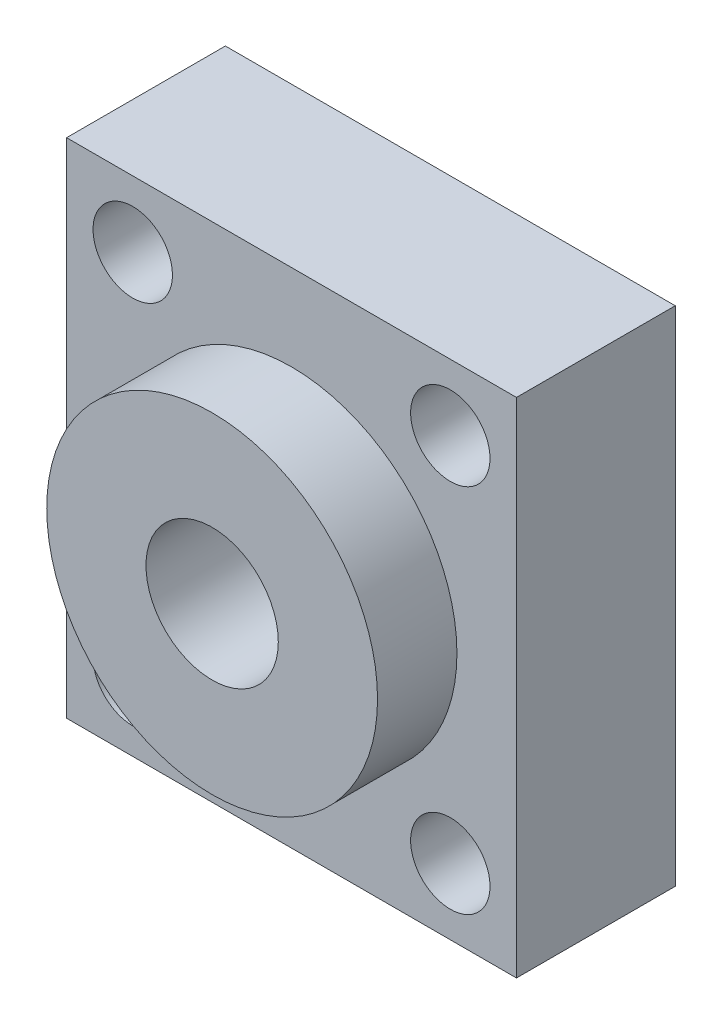
ISO-10303-21;
HEADER;
FILE_DESCRIPTION(('STEP AP214'),'2;1');
FILE_NAME('part.step','',(''),(''),'','','');
FILE_SCHEMA(('AUTOMOTIVE_DESIGN { 1 0 10303 214 1 1 1 1 }'));
ENDSEC;
DATA;
#1=APPLICATION_CONTEXT('core data for automotive mechanical design processes');
#2=APPLICATION_PROTOCOL_DEFINITION('international standard','automotive_design',2000,#1);
#3=PRODUCT_CONTEXT('',#1,'mechanical');
#4=PRODUCT('Part','Part','',(#3));
#5=PRODUCT_RELATED_PRODUCT_CATEGORY('part','',(#4));
#6=PRODUCT_DEFINITION_FORMATION('','',#4);
#7=PRODUCT_DEFINITION_CONTEXT('part definition',#1,'design');
#8=PRODUCT_DEFINITION('design','',#6,#7);
#9=PRODUCT_DEFINITION_SHAPE('','',#8);
#10=(LENGTH_UNIT() NAMED_UNIT(*) SI_UNIT(.MILLI.,.METRE.));
#11=(NAMED_UNIT(*) PLANE_ANGLE_UNIT() SI_UNIT($,.RADIAN.));
#12=(NAMED_UNIT(*) SI_UNIT($,.STERADIAN.) SOLID_ANGLE_UNIT());
#13=UNCERTAINTY_MEASURE_WITH_UNIT(LENGTH_MEASURE(1.E-05),#10,'distance_accuracy_value','');
#14=(GEOMETRIC_REPRESENTATION_CONTEXT(3) GLOBAL_UNCERTAINTY_ASSIGNED_CONTEXT((#13)) GLOBAL_UNIT_ASSIGNED_CONTEXT((#10,
#11,#12)) REPRESENTATION_CONTEXT('',''));
#15=CARTESIAN_POINT('',(0.,0.,0.));
#16=DIRECTION('',(0.,0.,1.));
#17=DIRECTION('',(1.,0.,0.));
#18=AXIS2_PLACEMENT_3D('',#15,#16,#17);
#19=CARTESIAN_POINT('',(-18.4444444444445,12.1111111111111,12.));
#20=DIRECTION('',(1.,0.,0.));
#21=DIRECTION('',(0.,1.,0.));
#22=AXIS2_PLACEMENT_3D('',#19,#20,#21);
#23=PLANE('',#22);
#24=DIRECTION('',(0.,-1.,0.));
#25=VECTOR('',#24,1.);
#26=CARTESIAN_POINT('',(-18.4444444444445,12.1111111111111,0.));
#27=LINE('',#26,#25);
#28=CARTESIAN_POINT('',(-18.4444444444445,12.1111111111111,0.));
#29=VERTEX_POINT('',#28);
#30=CARTESIAN_POINT('',(-18.4444444444444,-25.8888888888889,0.));
#31=VERTEX_POINT('',#30);
#32=EDGE_CURVE('E112',#29,#31,#27,.T.);
#33=ORIENTED_EDGE('',*,*,#32,.T.);
#34=DIRECTION('',(0.,0.,-1.));
#35=VECTOR('',#34,1.);
#36=CARTESIAN_POINT('',(-18.4444444444444,-25.8888888888889,12.));
#37=LINE('',#36,#35);
#38=CARTESIAN_POINT('',(-18.4444444444444,-25.8888888888889,12.));
#39=VERTEX_POINT('',#38);
#40=EDGE_CURVE('E44',#39,#31,#37,.T.);
#41=ORIENTED_EDGE('',*,*,#40,.F.);
#42=DIRECTION('',(0.,-1.,0.));
#43=VECTOR('',#42,1.);
#44=CARTESIAN_POINT('',(-18.4444444444445,12.1111111111111,12.));
#45=LINE('',#44,#43);
#46=CARTESIAN_POINT('',(-18.4444444444445,12.1111111111111,12.));
#47=VERTEX_POINT('',#46);
#48=EDGE_CURVE('E95',#47,#39,#45,.T.);
#49=ORIENTED_EDGE('',*,*,#48,.F.);
#50=DIRECTION('',(0.,0.,-1.));
#51=VECTOR('',#50,1.);
#52=CARTESIAN_POINT('',(-18.4444444444445,12.1111111111111,12.));
#53=LINE('',#52,#51);
#54=EDGE_CURVE('E108',#47,#29,#53,.T.);
#55=ORIENTED_EDGE('',*,*,#54,.T.);
#56=EDGE_LOOP('',(#33,#41,#49,#55));
#57=FACE_BOUND('',#56,.T.);
#58=ADVANCED_FACE('F41',(#57),#23,.F.);
#59=CARTESIAN_POINT('',(-18.4444444444444,-25.8888888888889,12.));
#60=DIRECTION('',(0.,1.,0.));
#61=DIRECTION('',(0.,0.,1.));
#62=AXIS2_PLACEMENT_3D('',#59,#60,#61);
#63=PLANE('',#62);
#64=DIRECTION('',(1.,0.,0.));
#65=VECTOR('',#64,1.);
#66=CARTESIAN_POINT('',(-18.4444444444444,-25.8888888888889,0.));
#67=LINE('',#66,#65);
#68=CARTESIAN_POINT('',(15.5555555555556,-25.8888888888889,0.));
#69=VERTEX_POINT('',#68);
#70=EDGE_CURVE('E101',#31,#69,#67,.T.);
#71=ORIENTED_EDGE('',*,*,#70,.T.);
#72=DIRECTION('',(0.,0.,-1.));
#73=VECTOR('',#72,1.);
#74=CARTESIAN_POINT('',(15.5555555555556,-25.8888888888889,12.));
#75=LINE('',#74,#73);
#76=CARTESIAN_POINT('',(15.5555555555556,-25.8888888888889,12.));
#77=VERTEX_POINT('',#76);
#78=EDGE_CURVE('E99',#77,#69,#75,.T.);
#79=ORIENTED_EDGE('',*,*,#78,.F.);
#80=DIRECTION('',(1.,0.,0.));
#81=VECTOR('',#80,1.);
#82=CARTESIAN_POINT('',(-18.4444444444444,-25.8888888888889,12.));
#83=LINE('',#82,#81);
#84=EDGE_CURVE('E90',#39,#77,#83,.T.);
#85=ORIENTED_EDGE('',*,*,#84,.F.);
#86=ORIENTED_EDGE('',*,*,#40,.T.);
#87=EDGE_LOOP('',(#71,#79,#85,#86));
#88=FACE_BOUND('',#87,.T.);
#89=ADVANCED_FACE('F100',(#88),#63,.F.);
#90=CARTESIAN_POINT('',(15.5555555555555,12.1111111111111,12.));
#91=DIRECTION('',(-1.,0.,0.));
#92=DIRECTION('',(0.,-1.,0.));
#93=AXIS2_PLACEMENT_3D('',#90,#91,#92);
#94=PLANE('',#93);
#95=DIRECTION('',(0.,1.,0.));
#96=VECTOR('',#95,1.);
#97=CARTESIAN_POINT('',(15.5555555555555,12.1111111111111,0.));
#98=LINE('',#97,#96);
#99=CARTESIAN_POINT('',(15.5555555555555,12.1111111111111,0.));
#100=VERTEX_POINT('',#99);
#101=EDGE_CURVE('E76',#69,#100,#98,.T.);
#102=ORIENTED_EDGE('',*,*,#101,.T.);
#103=DIRECTION('',(0.,0.,-1.));
#104=VECTOR('',#103,1.);
#105=CARTESIAN_POINT('',(15.5555555555555,12.1111111111111,12.));
#106=LINE('',#105,#104);
#107=CARTESIAN_POINT('',(15.5555555555555,12.1111111111111,12.));
#108=VERTEX_POINT('',#107);
#109=EDGE_CURVE('E103',#108,#100,#106,.T.);
#110=ORIENTED_EDGE('',*,*,#109,.F.);
#111=DIRECTION('',(0.,1.,0.));
#112=VECTOR('',#111,1.);
#113=CARTESIAN_POINT('',(15.5555555555555,12.1111111111111,12.));
#114=LINE('',#113,#112);
#115=EDGE_CURVE('E93',#77,#108,#114,.T.);
#116=ORIENTED_EDGE('',*,*,#115,.F.);
#117=ORIENTED_EDGE('',*,*,#78,.T.);
#118=EDGE_LOOP('',(#102,#110,#116,#117));
#119=FACE_BOUND('',#118,.T.);
#120=ADVANCED_FACE('F104',(#119),#94,.F.);
#121=CARTESIAN_POINT('',(-18.4444444444445,12.1111111111111,12.));
#122=DIRECTION('',(0.,-1.,0.));
#123=DIRECTION('',(0.,0.,-1.));
#124=AXIS2_PLACEMENT_3D('',#121,#122,#123);
#125=PLANE('',#124);
#126=DIRECTION('',(-1.,0.,0.));
#127=VECTOR('',#126,1.);
#128=CARTESIAN_POINT('',(-18.4444444444445,12.1111111111111,0.));
#129=LINE('',#128,#127);
#130=EDGE_CURVE('E82',#100,#29,#129,.T.);
#131=ORIENTED_EDGE('',*,*,#130,.T.);
#132=ORIENTED_EDGE('',*,*,#54,.F.);
#133=DIRECTION('',(-1.,0.,0.));
#134=VECTOR('',#133,1.);
#135=CARTESIAN_POINT('',(-18.4444444444445,12.1111111111111,12.));
#136=LINE('',#135,#134);
#137=EDGE_CURVE('E59',#108,#47,#136,.T.);
#138=ORIENTED_EDGE('',*,*,#137,.F.);
#139=ORIENTED_EDGE('',*,*,#109,.T.);
#140=EDGE_LOOP('',(#131,#132,#138,#139));
#141=FACE_BOUND('',#140,.T.);
#142=ADVANCED_FACE('F126',(#141),#125,.F.);
#143=CARTESIAN_POINT('',(0.,0.,12.));
#144=DIRECTION('',(0.,0.,1.));
#145=DIRECTION('',(1.,0.,0.));
#146=AXIS2_PLACEMENT_3D('',#143,#144,#145);
#147=PLANE('',#146);
#148=CARTESIAN_POINT('',(-13.4444444444444,-20.8888888888889,12.));
#149=DIRECTION('',(0.,0.,1.));
#150=DIRECTION('',(1.,0.,0.));
#151=AXIS2_PLACEMENT_3D('',#148,#149,#150);
#152=CIRCLE('',#151,3.);
#153=CARTESIAN_POINT('',(-10.4444444444444,-20.8888888888889,12.));
#154=VERTEX_POINT('',#153);
#155=EDGE_CURVE('E169',#154,#154,#152,.T.);
#156=ORIENTED_EDGE('',*,*,#155,.F.);
#157=EDGE_LOOP('',(#156));
#158=FACE_BOUND('',#157,.T.);
#159=CARTESIAN_POINT('',(10.5555555555555,7.11111111111111,12.));
#160=DIRECTION('',(0.,0.,1.));
#161=DIRECTION('',(1.,0.,0.));
#162=AXIS2_PLACEMENT_3D('',#159,#160,#161);
#163=CIRCLE('',#162,3.);
#164=CARTESIAN_POINT('',(13.5555555555555,7.11111111111111,12.));
#165=VERTEX_POINT('',#164);
#166=EDGE_CURVE('E161',#165,#165,#163,.T.);
#167=ORIENTED_EDGE('',*,*,#166,.F.);
#168=EDGE_LOOP('',(#167));
#169=FACE_BOUND('',#168,.T.);
#170=CARTESIAN_POINT('',(10.5555555555556,-20.8888888888889,12.));
#171=DIRECTION('',(0.,0.,1.));
#172=DIRECTION('',(1.,0.,0.));
#173=AXIS2_PLACEMENT_3D('',#170,#171,#172);
#174=CIRCLE('',#173,3.);
#175=CARTESIAN_POINT('',(13.5555555555556,-20.8888888888889,12.));
#176=VERTEX_POINT('',#175);
#177=EDGE_CURVE('E153',#176,#176,#174,.T.);
#178=ORIENTED_EDGE('',*,*,#177,.F.);
#179=EDGE_LOOP('',(#178));
#180=FACE_BOUND('',#179,.T.);
#181=CARTESIAN_POINT('',(-13.4444444444445,7.11111111111111,12.));
#182=DIRECTION('',(0.,0.,1.));
#183=DIRECTION('',(1.,0.,0.));
#184=AXIS2_PLACEMENT_3D('',#181,#182,#183);
#185=CIRCLE('',#184,3.);
#186=CARTESIAN_POINT('',(-10.4444444444445,7.11111111111111,12.));
#187=VERTEX_POINT('',#186);
#188=EDGE_CURVE('E145',#187,#187,#185,.T.);
#189=ORIENTED_EDGE('',*,*,#188,.F.);
#190=EDGE_LOOP('',(#189));
#191=FACE_BOUND('',#190,.T.);
#192=CARTESIAN_POINT('',(-1.44444444444445,-6.88888888888889,12.));
#193=DIRECTION('',(0.,0.,1.));
#194=DIRECTION('',(1.,0.,0.));
#195=AXIS2_PLACEMENT_3D('',#192,#193,#194);
#196=CIRCLE('',#195,12.5);
#197=CARTESIAN_POINT('',(11.0555555555556,-6.88888888888889,12.));
#198=VERTEX_POINT('',#197);
#199=EDGE_CURVE('E11',#198,#198,#196,.T.);
#200=ORIENTED_EDGE('',*,*,#199,.F.);
#201=EDGE_LOOP('',(#200));
#202=FACE_BOUND('',#201,.T.);
#203=ORIENTED_EDGE('',*,*,#48,.T.);
#204=ORIENTED_EDGE('',*,*,#84,.T.);
#205=ORIENTED_EDGE('',*,*,#115,.T.);
#206=ORIENTED_EDGE('',*,*,#137,.T.);
#207=EDGE_LOOP('',(#203,#204,#205,#206));
#208=FACE_BOUND('',#207,.T.);
#209=ADVANCED_FACE('F91',(#158,#169,#180,#191,#202,#208),#147,.T.);
#210=CARTESIAN_POINT('',(0.,0.,0.));
#211=DIRECTION('',(0.,0.,1.));
#212=DIRECTION('',(1.,0.,0.));
#213=AXIS2_PLACEMENT_3D('',#210,#211,#212);
#214=PLANE('',#213);
#215=CARTESIAN_POINT('',(-1.44444444444445,-6.88888888888889,0.));
#216=DIRECTION('',(0.,0.,1.));
#217=DIRECTION('',(1.,0.,0.));
#218=AXIS2_PLACEMENT_3D('',#215,#216,#217);
#219=CIRCLE('',#218,5.);
#220=CARTESIAN_POINT('',(3.55555555555555,-6.88888888888889,0.));
#221=VERTEX_POINT('',#220);
#222=EDGE_CURVE('E136',#221,#221,#219,.T.);
#223=ORIENTED_EDGE('',*,*,#222,.T.);
#224=EDGE_LOOP('',(#223));
#225=FACE_BOUND('',#224,.T.);
#226=ORIENTED_EDGE('',*,*,#32,.F.);
#227=ORIENTED_EDGE('',*,*,#130,.F.);
#228=ORIENTED_EDGE('',*,*,#101,.F.);
#229=ORIENTED_EDGE('',*,*,#70,.F.);
#230=EDGE_LOOP('',(#226,#227,#228,#229));
#231=FACE_BOUND('',#230,.T.);
#232=ADVANCED_FACE('F129',(#225,#231),#214,.F.);
#233=CARTESIAN_POINT('',(-1.44444444444445,-6.88888888888889,18.));
#234=DIRECTION('',(0.,0.,-1.));
#235=DIRECTION('',(-1.,0.,0.));
#236=AXIS2_PLACEMENT_3D('',#233,#234,#235);
#237=CYLINDRICAL_SURFACE('',#236,12.5);
#238=CARTESIAN_POINT('',(-1.44444444444445,-6.88888888888889,18.));
#239=DIRECTION('',(0.,0.,1.));
#240=DIRECTION('',(1.,0.,0.));
#241=AXIS2_PLACEMENT_3D('',#238,#239,#240);
#242=CIRCLE('',#241,12.5);
#243=CARTESIAN_POINT('',(11.0555555555556,-6.88888888888889,18.));
#244=VERTEX_POINT('',#243);
#245=EDGE_CURVE('E116',#244,#244,#242,.T.);
#246=ORIENTED_EDGE('',*,*,#245,.F.);
#247=EDGE_LOOP('',(#246));
#248=FACE_BOUND('',#247,.T.);
#249=ORIENTED_EDGE('',*,*,#199,.T.);
#250=EDGE_LOOP('',(#249));
#251=FACE_BOUND('',#250,.T.);
#252=ADVANCED_FACE('F197',(#248,#251),#237,.T.);
#253=CARTESIAN_POINT('',(-1.44444444444445,-6.88888888888889,18.));
#254=DIRECTION('',(0.,0.,1.));
#255=DIRECTION('',(1.,0.,0.));
#256=AXIS2_PLACEMENT_3D('',#253,#254,#255);
#257=PLANE('',#256);
#258=CARTESIAN_POINT('',(-1.44444444444445,-6.88888888888889,18.));
#259=DIRECTION('',(0.,0.,1.));
#260=DIRECTION('',(1.,0.,0.));
#261=AXIS2_PLACEMENT_3D('',#258,#259,#260);
#262=CIRCLE('',#261,5.);
#263=CARTESIAN_POINT('',(3.55555555555555,-6.88888888888889,18.));
#264=VERTEX_POINT('',#263);
#265=EDGE_CURVE('E140',#264,#264,#262,.T.);
#266=ORIENTED_EDGE('',*,*,#265,.F.);
#267=EDGE_LOOP('',(#266));
#268=FACE_BOUND('',#267,.T.);
#269=ORIENTED_EDGE('',*,*,#245,.T.);
#270=EDGE_LOOP('',(#269));
#271=FACE_BOUND('',#270,.T.);
#272=ADVANCED_FACE('F199',(#268,#271),#257,.T.);
#273=CARTESIAN_POINT('',(-1.44444444444445,-6.88888888888889,-82.));
#274=DIRECTION('',(0.,0.,1.));
#275=DIRECTION('',(1.,0.,0.));
#276=AXIS2_PLACEMENT_3D('',#273,#274,#275);
#277=CYLINDRICAL_SURFACE('',#276,5.);
#278=ORIENTED_EDGE('',*,*,#265,.T.);
#279=EDGE_LOOP('',(#278));
#280=FACE_BOUND('',#279,.T.);
#281=ORIENTED_EDGE('',*,*,#222,.F.);
#282=EDGE_LOOP('',(#281));
#283=FACE_BOUND('',#282,.T.);
#284=ADVANCED_FACE('F206',(#280,#283),#277,.F.);
#285=CARTESIAN_POINT('',(-13.4444444444445,7.11111111111111,7.));
#286=DIRECTION('',(0.,0.,1.));
#287=DIRECTION('',(1.,0.,0.));
#288=AXIS2_PLACEMENT_3D('',#285,#286,#287);
#289=CYLINDRICAL_SURFACE('',#288,3.);
#290=CARTESIAN_POINT('',(-13.4444444444445,7.11111111111111,7.));
#291=DIRECTION('',(0.,0.,1.));
#292=DIRECTION('',(1.,0.,0.));
#293=AXIS2_PLACEMENT_3D('',#290,#291,#292);
#294=CIRCLE('',#293,3.);
#295=CARTESIAN_POINT('',(-10.4444444444445,7.11111111111111,7.));
#296=VERTEX_POINT('',#295);
#297=EDGE_CURVE('E144',#296,#296,#294,.T.);
#298=ORIENTED_EDGE('',*,*,#297,.F.);
#299=EDGE_LOOP('',(#298));
#300=FACE_BOUND('',#299,.T.);
#301=ORIENTED_EDGE('',*,*,#188,.T.);
#302=EDGE_LOOP('',(#301));
#303=FACE_BOUND('',#302,.T.);
#304=ADVANCED_FACE('F254',(#300,#303),#289,.F.);
#305=CARTESIAN_POINT('',(-13.4444444444445,7.11111111111111,7.));
#306=DIRECTION('',(0.,0.,1.));
#307=DIRECTION('',(1.,0.,0.));
#308=AXIS2_PLACEMENT_3D('',#305,#306,#307);
#309=PLANE('',#308);
#310=ORIENTED_EDGE('',*,*,#297,.T.);
#311=EDGE_LOOP('',(#310));
#312=FACE_BOUND('',#311,.T.);
#313=ADVANCED_FACE('F263',(#312),#309,.T.);
#314=CARTESIAN_POINT('',(10.5555555555556,-20.8888888888889,7.));
#315=DIRECTION('',(0.,0.,1.));
#316=DIRECTION('',(1.,0.,0.));
#317=AXIS2_PLACEMENT_3D('',#314,#315,#316);
#318=CYLINDRICAL_SURFACE('',#317,3.);
#319=CARTESIAN_POINT('',(10.5555555555556,-20.8888888888889,7.));
#320=DIRECTION('',(0.,0.,1.));
#321=DIRECTION('',(1.,0.,0.));
#322=AXIS2_PLACEMENT_3D('',#319,#320,#321);
#323=CIRCLE('',#322,3.);
#324=CARTESIAN_POINT('',(13.5555555555556,-20.8888888888889,7.));
#325=VERTEX_POINT('',#324);
#326=EDGE_CURVE('E157',#325,#325,#323,.T.);
#327=ORIENTED_EDGE('',*,*,#326,.F.);
#328=EDGE_LOOP('',(#327));
#329=FACE_BOUND('',#328,.T.);
#330=ORIENTED_EDGE('',*,*,#177,.T.);
#331=EDGE_LOOP('',(#330));
#332=FACE_BOUND('',#331,.T.);
#333=ADVANCED_FACE('F272',(#329,#332),#318,.F.);
#334=CARTESIAN_POINT('',(10.5555555555556,-20.8888888888889,7.));
#335=DIRECTION('',(0.,0.,1.));
#336=DIRECTION('',(1.,0.,0.));
#337=AXIS2_PLACEMENT_3D('',#334,#335,#336);
#338=PLANE('',#337);
#339=ORIENTED_EDGE('',*,*,#326,.T.);
#340=EDGE_LOOP('',(#339));
#341=FACE_BOUND('',#340,.T.);
#342=ADVANCED_FACE('F282',(#341),#338,.T.);
#343=CARTESIAN_POINT('',(10.5555555555555,7.11111111111111,7.));
#344=DIRECTION('',(0.,0.,1.));
#345=DIRECTION('',(1.,0.,0.));
#346=AXIS2_PLACEMENT_3D('',#343,#344,#345);
#347=CYLINDRICAL_SURFACE('',#346,3.);
#348=CARTESIAN_POINT('',(10.5555555555555,7.11111111111111,7.));
#349=DIRECTION('',(0.,0.,1.));
#350=DIRECTION('',(1.,0.,0.));
#351=AXIS2_PLACEMENT_3D('',#348,#349,#350);
#352=CIRCLE('',#351,3.);
#353=CARTESIAN_POINT('',(13.5555555555555,7.11111111111111,7.));
#354=VERTEX_POINT('',#353);
#355=EDGE_CURVE('E165',#354,#354,#352,.T.);
#356=ORIENTED_EDGE('',*,*,#355,.F.);
#357=EDGE_LOOP('',(#356));
#358=FACE_BOUND('',#357,.T.);
#359=ORIENTED_EDGE('',*,*,#166,.T.);
#360=EDGE_LOOP('',(#359));
#361=FACE_BOUND('',#360,.T.);
#362=ADVANCED_FACE('F289',(#358,#361),#347,.F.);
#363=CARTESIAN_POINT('',(10.5555555555555,7.11111111111111,7.));
#364=DIRECTION('',(0.,0.,1.));
#365=DIRECTION('',(1.,0.,0.));
#366=AXIS2_PLACEMENT_3D('',#363,#364,#365);
#367=PLANE('',#366);
#368=ORIENTED_EDGE('',*,*,#355,.T.);
#369=EDGE_LOOP('',(#368));
#370=FACE_BOUND('',#369,.T.);
#371=ADVANCED_FACE('F182',(#370),#367,.T.);
#372=CARTESIAN_POINT('',(-13.4444444444444,-20.8888888888889,7.));
#373=DIRECTION('',(0.,0.,1.));
#374=DIRECTION('',(1.,0.,0.));
#375=AXIS2_PLACEMENT_3D('',#372,#373,#374);
#376=CYLINDRICAL_SURFACE('',#375,3.);
#377=CARTESIAN_POINT('',(-13.4444444444444,-20.8888888888889,7.));
#378=DIRECTION('',(0.,0.,1.));
#379=DIRECTION('',(1.,0.,0.));
#380=AXIS2_PLACEMENT_3D('',#377,#378,#379);
#381=CIRCLE('',#380,3.);
#382=CARTESIAN_POINT('',(-10.4444444444444,-20.8888888888889,7.));
#383=VERTEX_POINT('',#382);
#384=EDGE_CURVE('E149',#383,#383,#381,.T.);
#385=ORIENTED_EDGE('',*,*,#384,.F.);
#386=EDGE_LOOP('',(#385));
#387=FACE_BOUND('',#386,.T.);
#388=ORIENTED_EDGE('',*,*,#155,.T.);
#389=EDGE_LOOP('',(#388));
#390=FACE_BOUND('',#389,.T.);
#391=ADVANCED_FACE('F179',(#387,#390),#376,.F.);
#392=CARTESIAN_POINT('',(-13.4444444444444,-20.8888888888889,7.));
#393=DIRECTION('',(0.,0.,1.));
#394=DIRECTION('',(1.,0.,0.));
#395=AXIS2_PLACEMENT_3D('',#392,#393,#394);
#396=PLANE('',#395);
#397=ORIENTED_EDGE('',*,*,#384,.T.);
#398=EDGE_LOOP('',(#397));
#399=FACE_BOUND('',#398,.T.);
#400=ADVANCED_FACE('F177',(#399),#396,.T.);
#401=CLOSED_SHELL('',(#58,#89,#120,#142,#209,#232,#252,#272,#284,#304,#313,#333,#342,#362,#371,
#391,#400));
#402=MANIFOLD_SOLID_BREP('B2',#401);
#403=ADVANCED_BREP_SHAPE_REPRESENTATION('',(#18,#402),#14);
#404=SHAPE_DEFINITION_REPRESENTATION(#9,#403);
ENDSEC;
END-ISO-10303-21;
